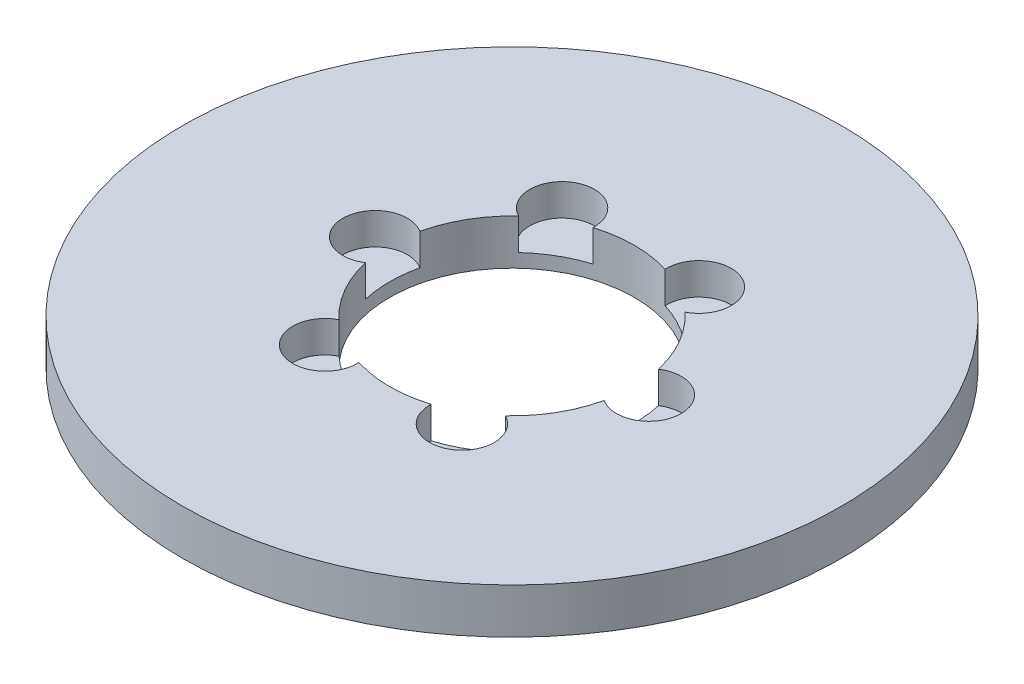
ISO-10303-21;
HEADER;
FILE_DESCRIPTION(('STEP AP214'),'2;1');
FILE_NAME('part.step','',(''),(''),'','','');
FILE_SCHEMA(('AUTOMOTIVE_DESIGN { 1 0 10303 214 1 1 1 1 }'));
ENDSEC;
DATA;
#1=APPLICATION_CONTEXT('core data for automotive mechanical design processes');
#2=APPLICATION_PROTOCOL_DEFINITION('international standard','automotive_design',2000,#1);
#3=PRODUCT_CONTEXT('',#1,'mechanical');
#4=PRODUCT('Part','Part','',(#3));
#5=PRODUCT_RELATED_PRODUCT_CATEGORY('part','',(#4));
#6=PRODUCT_DEFINITION_FORMATION('','',#4);
#7=PRODUCT_DEFINITION_CONTEXT('part definition',#1,'design');
#8=PRODUCT_DEFINITION('design','',#6,#7);
#9=PRODUCT_DEFINITION_SHAPE('','',#8);
#10=(LENGTH_UNIT() NAMED_UNIT(*) SI_UNIT(.MILLI.,.METRE.));
#11=(NAMED_UNIT(*) PLANE_ANGLE_UNIT() SI_UNIT($,.RADIAN.));
#12=(NAMED_UNIT(*) SI_UNIT($,.STERADIAN.) SOLID_ANGLE_UNIT());
#13=UNCERTAINTY_MEASURE_WITH_UNIT(LENGTH_MEASURE(1.E-05),#10,'distance_accuracy_value','');
#14=(GEOMETRIC_REPRESENTATION_CONTEXT(3) GLOBAL_UNCERTAINTY_ASSIGNED_CONTEXT((#13)) GLOBAL_UNIT_ASSIGNED_CONTEXT((#10,
#11,#12)) REPRESENTATION_CONTEXT('',''));
#15=CARTESIAN_POINT('',(0.,0.,0.));
#16=DIRECTION('',(0.,0.,1.));
#17=DIRECTION('',(1.,0.,0.));
#18=AXIS2_PLACEMENT_3D('',#15,#16,#17);
#19=CARTESIAN_POINT('',(0.,12.,0.));
#20=DIRECTION('',(0.,-1.,0.));
#21=DIRECTION('',(0.,0.,-1.));
#22=AXIS2_PLACEMENT_3D('',#19,#20,#21);
#23=CYLINDRICAL_SURFACE('',#22,87.5);
#24=CARTESIAN_POINT('',(0.,12.,0.));
#25=DIRECTION('',(0.,1.,0.));
#26=DIRECTION('',(0.,0.,1.));
#27=AXIS2_PLACEMENT_3D('',#24,#25,#26);
#28=CIRCLE('',#27,87.5);
#29=CARTESIAN_POINT('',(0.,12.,87.5));
#30=VERTEX_POINT('',#29);
#31=EDGE_CURVE('E171',#30,#30,#28,.T.);
#32=ORIENTED_EDGE('',*,*,#31,.F.);
#33=EDGE_LOOP('',(#32));
#34=FACE_BOUND('',#33,.T.);
#35=CARTESIAN_POINT('',(0.,0.,0.));
#36=DIRECTION('',(0.,1.,0.));
#37=DIRECTION('',(0.,0.,1.));
#38=AXIS2_PLACEMENT_3D('',#35,#36,#37);
#39=CIRCLE('',#38,87.5);
#40=CARTESIAN_POINT('',(0.,0.,87.5));
#41=VERTEX_POINT('',#40);
#42=EDGE_CURVE('E157',#41,#41,#39,.T.);
#43=ORIENTED_EDGE('',*,*,#42,.T.);
#44=EDGE_LOOP('',(#43));
#45=FACE_BOUND('',#44,.T.);
#46=ADVANCED_FACE('F39',(#34,#45),#23,.T.);
#47=CARTESIAN_POINT('',(0.,12.,0.));
#48=DIRECTION('',(0.,1.,0.));
#49=DIRECTION('',(0.,0.,1.));
#50=AXIS2_PLACEMENT_3D('',#47,#48,#49);
#51=PLANE('',#50);
#52=CARTESIAN_POINT('',(-18.1668003303775,12.,-31.465821183172));
#53=DIRECTION('',(0.,1.,0.));
#54=DIRECTION('',(-0.866025403784433,0.,0.50000000000001));
#55=AXIS2_PLACEMENT_3D('',#52,#53,#54);
#56=CIRCLE('',#55,8.58563519794542);
#57=CARTESIAN_POINT('',(-9.59111765397226,12.,-31.0525435696927));
#58=VERTEX_POINT('',#57);
#59=CARTESIAN_POINT('',(-22.0967327564914,12.,-23.8324233238712));
#60=VERTEX_POINT('',#59);
#61=EDGE_CURVE('E214',#58,#60,#56,.T.);
#62=ORIENTED_EDGE('',*,*,#61,.F.);
#63=CARTESIAN_POINT('',(0.,12.,0.));
#64=DIRECTION('',(0.,1.,0.));
#65=DIRECTION('',(0.,0.,1.));
#66=AXIS2_PLACEMENT_3D('',#63,#64,#65);
#67=CIRCLE('',#66,32.5);
#68=CARTESIAN_POINT('',(9.59111765397161,12.,-31.0525435696929));
#69=VERTEX_POINT('',#68);
#70=EDGE_CURVE('E272',#69,#58,#67,.T.);
#71=ORIENTED_EDGE('',*,*,#70,.F.);
#72=CARTESIAN_POINT('',(18.1668003303768,12.,-31.4658211831723));
#73=DIRECTION('',(0.,1.,0.));
#74=DIRECTION('',(-0.866025403784443,0.,-0.499999999999992));
#75=AXIS2_PLACEMENT_3D('',#72,#73,#74);
#76=CIRCLE('',#75,8.58563519794542);
#77=CARTESIAN_POINT('',(22.0967327564909,12.,-23.8324233238717));
#78=VERTEX_POINT('',#77);
#79=EDGE_CURVE('E285',#78,#69,#76,.T.);
#80=ORIENTED_EDGE('',*,*,#79,.F.);
#81=CARTESIAN_POINT('',(31.687850410463,12.,-7.22012024582133));
#82=VERTEX_POINT('',#81);
#83=EDGE_CURVE('E165',#82,#78,#67,.T.);
#84=ORIENTED_EDGE('',*,*,#83,.F.);
#85=CARTESIAN_POINT('',(36.3336006607542,12.,0.));
#86=DIRECTION('',(0.,1.,0.));
#87=DIRECTION('',(0.,0.,-1.));
#88=AXIS2_PLACEMENT_3D('',#85,#86,#87);
#89=CIRCLE('',#88,8.58563519794542);
#90=CARTESIAN_POINT('',(31.687850410463,12.,7.22012024582133));
#91=VERTEX_POINT('',#90);
#92=EDGE_CURVE('E281',#91,#82,#89,.T.);
#93=ORIENTED_EDGE('',*,*,#92,.F.);
#94=CARTESIAN_POINT('',(22.0967327564912,12.,23.8324233238714));
#95=VERTEX_POINT('',#94);
#96=EDGE_CURVE('E160',#95,#91,#67,.T.);
#97=ORIENTED_EDGE('',*,*,#96,.F.);
#98=CARTESIAN_POINT('',(18.1668003303772,12.,31.4658211831721));
#99=DIRECTION('',(0.,1.,0.));
#100=DIRECTION('',(0.866025403784436,0.,-0.500000000000004));
#101=AXIS2_PLACEMENT_3D('',#98,#99,#100);
#102=CIRCLE('',#101,8.58563519794542);
#103=CARTESIAN_POINT('',(9.59111765397204,12.,31.0525435696927));
#104=VERTEX_POINT('',#103);
#105=EDGE_CURVE('E154',#104,#95,#102,.T.);
#106=ORIENTED_EDGE('',*,*,#105,.F.);
#107=CARTESIAN_POINT('',(-9.59111765397182,12.,31.0525435696928));
#108=VERTEX_POINT('',#107);
#109=EDGE_CURVE('E150',#108,#104,#67,.T.);
#110=ORIENTED_EDGE('',*,*,#109,.F.);
#111=CARTESIAN_POINT('',(-18.166800330377,12.,31.4658211831722));
#112=DIRECTION('',(0.,1.,0.));
#113=DIRECTION('',(0.86602540378444,0.,0.499999999999998));
#114=AXIS2_PLACEMENT_3D('',#111,#112,#113);
#115=CIRCLE('',#114,8.58563519794542);
#116=CARTESIAN_POINT('',(-22.0967327564911,12.,23.8324233238715));
#117=VERTEX_POINT('',#116);
#118=EDGE_CURVE('E127',#117,#108,#115,.T.);
#119=ORIENTED_EDGE('',*,*,#118,.F.);
#120=CARTESIAN_POINT('',(-31.687850410463,12.,7.22012024582133));
#121=VERTEX_POINT('',#120);
#122=EDGE_CURVE('E156',#121,#117,#67,.T.);
#123=ORIENTED_EDGE('',*,*,#122,.F.);
#124=CARTESIAN_POINT('',(-36.3336006607542,12.,0.));
#125=DIRECTION('',(0.,1.,0.));
#126=DIRECTION('',(0.,0.,1.));
#127=AXIS2_PLACEMENT_3D('',#124,#125,#126);
#128=CIRCLE('',#127,8.58563519794542);
#129=CARTESIAN_POINT('',(-31.687850410463,12.,-7.22012024582133));
#130=VERTEX_POINT('',#129);
#131=EDGE_CURVE('E164',#130,#121,#128,.T.);
#132=ORIENTED_EDGE('',*,*,#131,.F.);
#133=EDGE_CURVE('E159',#60,#130,#67,.T.);
#134=ORIENTED_EDGE('',*,*,#133,.F.);
#135=EDGE_LOOP('',(#62,#71,#80,#84,#93,#97,#106,#110,#119,#123,#132,#134));
#136=FACE_BOUND('',#135,.T.);
#137=ORIENTED_EDGE('',*,*,#31,.T.);
#138=EDGE_LOOP('',(#137));
#139=FACE_BOUND('',#138,.T.);
#140=ADVANCED_FACE('F155',(#136,#139),#51,.T.);
#141=CARTESIAN_POINT('',(0.,0.,0.));
#142=DIRECTION('',(0.,1.,0.));
#143=DIRECTION('',(0.,0.,1.));
#144=AXIS2_PLACEMENT_3D('',#141,#142,#143);
#145=PLANE('',#144);
#146=CARTESIAN_POINT('',(0.,0.,0.));
#147=DIRECTION('',(0.,1.,0.));
#148=DIRECTION('',(0.,0.,1.));
#149=AXIS2_PLACEMENT_3D('',#146,#147,#148);
#150=CIRCLE('',#149,32.5);
#151=CARTESIAN_POINT('',(0.,0.,32.5));
#152=VERTEX_POINT('',#151);
#153=EDGE_CURVE('E170',#152,#152,#150,.T.);
#154=ORIENTED_EDGE('',*,*,#153,.T.);
#155=EDGE_LOOP('',(#154));
#156=FACE_BOUND('',#155,.T.);
#157=ORIENTED_EDGE('',*,*,#42,.F.);
#158=EDGE_LOOP('',(#157));
#159=FACE_BOUND('',#158,.T.);
#160=ADVANCED_FACE('F232',(#156,#159),#145,.F.);
#161=CARTESIAN_POINT('',(0.,12.,0.));
#162=DIRECTION('',(0.,-1.,0.));
#163=DIRECTION('',(0.,0.,-1.));
#164=AXIS2_PLACEMENT_3D('',#161,#162,#163);
#165=CYLINDRICAL_SURFACE('',#164,32.5);
#166=DIRECTION('',(0.,1.,0.));
#167=VECTOR('',#166,1.);
#168=CARTESIAN_POINT('',(-9.59111765397226,7.80302718455818,-31.0525435696927));
#169=LINE('',#168,#167);
#170=CARTESIAN_POINT('',(-9.59111765397226,3.60605436911637,-31.0525435696927));
#171=VERTEX_POINT('',#170);
#172=EDGE_CURVE('E11',#171,#58,#169,.T.);
#173=ORIENTED_EDGE('',*,*,#172,.F.);
#174=CARTESIAN_POINT('',(0.,3.60605436911637,0.));
#175=DIRECTION('',(0.,1.,0.));
#176=DIRECTION('',(0.,0.,1.));
#177=AXIS2_PLACEMENT_3D('',#174,#175,#176);
#178=CIRCLE('',#177,32.5);
#179=CARTESIAN_POINT('',(-22.0967327564914,3.60605436911637,-23.8324233238712));
#180=VERTEX_POINT('',#179);
#181=EDGE_CURVE('E209',#171,#180,#178,.T.);
#182=ORIENTED_EDGE('',*,*,#181,.T.);
#183=DIRECTION('',(0.,1.,0.));
#184=VECTOR('',#183,1.);
#185=CARTESIAN_POINT('',(-22.0967327564914,7.80302718455818,-23.8324233238712));
#186=LINE('',#185,#184);
#187=EDGE_CURVE('E46',#60,#180,#186,.F.);
#188=ORIENTED_EDGE('',*,*,#187,.F.);
#189=ORIENTED_EDGE('',*,*,#133,.T.);
#190=DIRECTION('',(0.,1.,0.));
#191=VECTOR('',#190,1.);
#192=CARTESIAN_POINT('',(-31.687850410463,7.80302718455818,-7.22012024582133));
#193=LINE('',#192,#191);
#194=CARTESIAN_POINT('',(-31.687850410463,3.60605436911637,-7.22012024582133));
#195=VERTEX_POINT('',#194);
#196=EDGE_CURVE('E185',#195,#130,#193,.T.);
#197=ORIENTED_EDGE('',*,*,#196,.F.);
#198=CARTESIAN_POINT('',(0.,3.60605436911637,0.));
#199=DIRECTION('',(0.,1.,0.));
#200=DIRECTION('',(0.,0.,1.));
#201=AXIS2_PLACEMENT_3D('',#198,#199,#200);
#202=CIRCLE('',#201,32.5);
#203=CARTESIAN_POINT('',(-31.687850410463,3.60605436911637,7.22012024582133));
#204=VERTEX_POINT('',#203);
#205=EDGE_CURVE('E173',#195,#204,#202,.T.);
#206=ORIENTED_EDGE('',*,*,#205,.T.);
#207=DIRECTION('',(0.,1.,0.));
#208=VECTOR('',#207,1.);
#209=CARTESIAN_POINT('',(-31.687850410463,7.80302718455818,7.22012024582133));
#210=LINE('',#209,#208);
#211=EDGE_CURVE('E178',#121,#204,#210,.F.);
#212=ORIENTED_EDGE('',*,*,#211,.F.);
#213=ORIENTED_EDGE('',*,*,#122,.T.);
#214=DIRECTION('',(0.,1.,0.));
#215=VECTOR('',#214,1.);
#216=CARTESIAN_POINT('',(-22.0967327564911,7.80302718455818,23.8324233238715));
#217=LINE('',#216,#215);
#218=CARTESIAN_POINT('',(-22.0967327564911,3.60605436911637,23.8324233238715));
#219=VERTEX_POINT('',#218);
#220=EDGE_CURVE('E132',#219,#117,#217,.T.);
#221=ORIENTED_EDGE('',*,*,#220,.F.);
#222=CARTESIAN_POINT('',(0.,3.60605436911637,0.));
#223=DIRECTION('',(0.,1.,0.));
#224=DIRECTION('',(0.,0.,1.));
#225=AXIS2_PLACEMENT_3D('',#222,#223,#224);
#226=CIRCLE('',#225,32.5);
#227=CARTESIAN_POINT('',(-9.59111765397182,3.60605436911637,31.0525435696928));
#228=VERTEX_POINT('',#227);
#229=EDGE_CURVE('E146',#219,#228,#226,.T.);
#230=ORIENTED_EDGE('',*,*,#229,.T.);
#231=DIRECTION('',(0.,1.,0.));
#232=VECTOR('',#231,1.);
#233=CARTESIAN_POINT('',(-9.59111765397182,7.80302718455818,31.0525435696928));
#234=LINE('',#233,#232);
#235=EDGE_CURVE('E128',#108,#228,#234,.F.);
#236=ORIENTED_EDGE('',*,*,#235,.F.);
#237=ORIENTED_EDGE('',*,*,#109,.T.);
#238=DIRECTION('',(0.,1.,0.));
#239=VECTOR('',#238,1.);
#240=CARTESIAN_POINT('',(9.59111765397204,7.80302718455818,31.0525435696927));
#241=LINE('',#240,#239);
#242=CARTESIAN_POINT('',(9.59111765397204,3.60605436911637,31.0525435696927));
#243=VERTEX_POINT('',#242);
#244=EDGE_CURVE('E192',#243,#104,#241,.T.);
#245=ORIENTED_EDGE('',*,*,#244,.F.);
#246=CARTESIAN_POINT('',(0.,3.60605436911637,0.));
#247=DIRECTION('',(0.,1.,0.));
#248=DIRECTION('',(0.,0.,1.));
#249=AXIS2_PLACEMENT_3D('',#246,#247,#248);
#250=CIRCLE('',#249,32.5);
#251=CARTESIAN_POINT('',(22.0967327564912,3.60605436911637,23.8324233238714));
#252=VERTEX_POINT('',#251);
#253=EDGE_CURVE('E190',#243,#252,#250,.T.);
#254=ORIENTED_EDGE('',*,*,#253,.T.);
#255=DIRECTION('',(0.,1.,0.));
#256=VECTOR('',#255,1.);
#257=CARTESIAN_POINT('',(22.0967327564912,7.80302718455818,23.8324233238714));
#258=LINE('',#257,#256);
#259=EDGE_CURVE('E189',#95,#252,#258,.F.);
#260=ORIENTED_EDGE('',*,*,#259,.F.);
#261=ORIENTED_EDGE('',*,*,#96,.T.);
#262=DIRECTION('',(0.,1.,0.));
#263=VECTOR('',#262,1.);
#264=CARTESIAN_POINT('',(31.687850410463,7.80302718455818,7.22012024582133));
#265=LINE('',#264,#263);
#266=CARTESIAN_POINT('',(31.687850410463,3.60605436911637,7.22012024582133));
#267=VERTEX_POINT('',#266);
#268=EDGE_CURVE('E203',#267,#91,#265,.T.);
#269=ORIENTED_EDGE('',*,*,#268,.F.);
#270=CARTESIAN_POINT('',(0.,3.60605436911637,0.));
#271=DIRECTION('',(0.,1.,0.));
#272=DIRECTION('',(0.,0.,1.));
#273=AXIS2_PLACEMENT_3D('',#270,#271,#272);
#274=CIRCLE('',#273,32.5);
#275=CARTESIAN_POINT('',(31.687850410463,3.60605436911637,-7.22012024582133));
#276=VERTEX_POINT('',#275);
#277=EDGE_CURVE('E194',#267,#276,#274,.T.);
#278=ORIENTED_EDGE('',*,*,#277,.T.);
#279=DIRECTION('',(0.,1.,0.));
#280=VECTOR('',#279,1.);
#281=CARTESIAN_POINT('',(31.687850410463,7.80302718455818,-7.22012024582133));
#282=LINE('',#281,#280);
#283=EDGE_CURVE('E196',#82,#276,#282,.F.);
#284=ORIENTED_EDGE('',*,*,#283,.F.);
#285=ORIENTED_EDGE('',*,*,#83,.T.);
#286=DIRECTION('',(0.,1.,0.));
#287=VECTOR('',#286,1.);
#288=CARTESIAN_POINT('',(22.0967327564909,7.80302718455818,-23.8324233238717));
#289=LINE('',#288,#287);
#290=CARTESIAN_POINT('',(22.0967327564909,3.60605436911637,-23.8324233238717));
#291=VERTEX_POINT('',#290);
#292=EDGE_CURVE('E208',#291,#78,#289,.T.);
#293=ORIENTED_EDGE('',*,*,#292,.F.);
#294=CARTESIAN_POINT('',(0.,3.60605436911637,0.));
#295=DIRECTION('',(0.,1.,0.));
#296=DIRECTION('',(0.,0.,1.));
#297=AXIS2_PLACEMENT_3D('',#294,#295,#296);
#298=CIRCLE('',#297,32.5);
#299=CARTESIAN_POINT('',(9.59111765397161,3.60605436911637,-31.0525435696929));
#300=VERTEX_POINT('',#299);
#301=EDGE_CURVE('E201',#291,#300,#298,.T.);
#302=ORIENTED_EDGE('',*,*,#301,.T.);
#303=DIRECTION('',(0.,1.,0.));
#304=VECTOR('',#303,1.);
#305=CARTESIAN_POINT('',(9.59111765397161,7.80302718455818,-31.0525435696929));
#306=LINE('',#305,#304);
#307=EDGE_CURVE('E206',#69,#300,#306,.F.);
#308=ORIENTED_EDGE('',*,*,#307,.F.);
#309=ORIENTED_EDGE('',*,*,#70,.T.);
#310=EDGE_LOOP('',(#173,#182,#188,#189,#197,#206,#212,#213,#221,#230,#236,#237,#245,#254,#260,
#261,#269,#278,#284,#285,#293,#302,#308,#309));
#311=FACE_BOUND('',#310,.T.);
#312=ORIENTED_EDGE('',*,*,#153,.F.);
#313=EDGE_LOOP('',(#312));
#314=FACE_BOUND('',#313,.T.);
#315=ADVANCED_FACE('F145',(#311,#314),#165,.F.);
#316=CARTESIAN_POINT('',(-36.3336006607542,3.60605436911637,0.));
#317=DIRECTION('',(0.,1.,0.));
#318=DIRECTION('',(0.,0.,1.));
#319=AXIS2_PLACEMENT_3D('',#316,#317,#318);
#320=CYLINDRICAL_SURFACE('',#319,8.58563519794542);
#321=ORIENTED_EDGE('',*,*,#196,.T.);
#322=ORIENTED_EDGE('',*,*,#131,.T.);
#323=ORIENTED_EDGE('',*,*,#211,.T.);
#324=CARTESIAN_POINT('',(-36.3336006607542,3.60605436911637,0.));
#325=DIRECTION('',(0.,1.,0.));
#326=DIRECTION('',(0.,0.,1.));
#327=AXIS2_PLACEMENT_3D('',#324,#325,#326);
#328=CIRCLE('',#327,8.58563519794542);
#329=EDGE_CURVE('E168',#195,#204,#328,.T.);
#330=ORIENTED_EDGE('',*,*,#329,.F.);
#331=EDGE_LOOP('',(#321,#322,#323,#330));
#332=FACE_BOUND('',#331,.T.);
#333=ADVANCED_FACE('F243',(#332),#320,.F.);
#334=CARTESIAN_POINT('',(-36.3336006607542,3.60605436911637,0.));
#335=DIRECTION('',(0.,1.,0.));
#336=DIRECTION('',(0.,0.,1.));
#337=AXIS2_PLACEMENT_3D('',#334,#335,#336);
#338=PLANE('',#337);
#339=ORIENTED_EDGE('',*,*,#329,.T.);
#340=ORIENTED_EDGE('',*,*,#205,.F.);
#341=EDGE_LOOP('',(#339,#340));
#342=FACE_BOUND('',#341,.T.);
#343=ADVANCED_FACE('F247',(#342),#338,.T.);
#344=CARTESIAN_POINT('',(-18.166800330377,3.60605436911637,31.4658211831722));
#345=DIRECTION('',(0.,1.,0.));
#346=DIRECTION('',(0.,0.,1.));
#347=AXIS2_PLACEMENT_3D('',#344,#345,#346);
#348=CYLINDRICAL_SURFACE('',#347,8.58563519794542);
#349=ORIENTED_EDGE('',*,*,#220,.T.);
#350=ORIENTED_EDGE('',*,*,#118,.T.);
#351=ORIENTED_EDGE('',*,*,#235,.T.);
#352=CARTESIAN_POINT('',(-18.166800330377,3.60605436911637,31.4658211831722));
#353=DIRECTION('',(0.,1.,0.));
#354=DIRECTION('',(0.86602540378444,0.,0.499999999999998));
#355=AXIS2_PLACEMENT_3D('',#352,#353,#354);
#356=CIRCLE('',#355,8.58563519794542);
#357=EDGE_CURVE('E137',#219,#228,#356,.T.);
#358=ORIENTED_EDGE('',*,*,#357,.F.);
#359=EDGE_LOOP('',(#349,#350,#351,#358));
#360=FACE_BOUND('',#359,.T.);
#361=ADVANCED_FACE('F126',(#360),#348,.F.);
#362=CARTESIAN_POINT('',(-18.166800330377,3.60605436911637,31.4658211831722));
#363=DIRECTION('',(0.,1.,0.));
#364=DIRECTION('',(0.86602540378444,0.,0.499999999999998));
#365=AXIS2_PLACEMENT_3D('',#362,#363,#364);
#366=PLANE('',#365);
#367=ORIENTED_EDGE('',*,*,#357,.T.);
#368=ORIENTED_EDGE('',*,*,#229,.F.);
#369=EDGE_LOOP('',(#367,#368));
#370=FACE_BOUND('',#369,.T.);
#371=ADVANCED_FACE('F254',(#370),#366,.T.);
#372=CARTESIAN_POINT('',(18.1668003303772,3.60605436911637,31.4658211831721));
#373=DIRECTION('',(0.,1.,0.));
#374=DIRECTION('',(0.,0.,1.));
#375=AXIS2_PLACEMENT_3D('',#372,#373,#374);
#376=CYLINDRICAL_SURFACE('',#375,8.58563519794542);
#377=ORIENTED_EDGE('',*,*,#244,.T.);
#378=ORIENTED_EDGE('',*,*,#105,.T.);
#379=ORIENTED_EDGE('',*,*,#259,.T.);
#380=CARTESIAN_POINT('',(18.1668003303772,3.60605436911637,31.4658211831721));
#381=DIRECTION('',(0.,1.,0.));
#382=DIRECTION('',(0.866025403784436,0.,-0.500000000000004));
#383=AXIS2_PLACEMENT_3D('',#380,#381,#382);
#384=CIRCLE('',#383,8.58563519794542);
#385=EDGE_CURVE('E138',#243,#252,#384,.T.);
#386=ORIENTED_EDGE('',*,*,#385,.F.);
#387=EDGE_LOOP('',(#377,#378,#379,#386));
#388=FACE_BOUND('',#387,.T.);
#389=ADVANCED_FACE('F260',(#388),#376,.F.);
#390=CARTESIAN_POINT('',(18.1668003303772,3.60605436911637,31.4658211831721));
#391=DIRECTION('',(0.,1.,0.));
#392=DIRECTION('',(0.866025403784436,0.,-0.500000000000004));
#393=AXIS2_PLACEMENT_3D('',#390,#391,#392);
#394=PLANE('',#393);
#395=ORIENTED_EDGE('',*,*,#385,.T.);
#396=ORIENTED_EDGE('',*,*,#253,.F.);
#397=EDGE_LOOP('',(#395,#396));
#398=FACE_BOUND('',#397,.T.);
#399=ADVANCED_FACE('F265',(#398),#394,.T.);
#400=CARTESIAN_POINT('',(36.3336006607542,3.60605436911637,0.));
#401=DIRECTION('',(0.,1.,0.));
#402=DIRECTION('',(0.,0.,1.));
#403=AXIS2_PLACEMENT_3D('',#400,#401,#402);
#404=CYLINDRICAL_SURFACE('',#403,8.58563519794542);
#405=ORIENTED_EDGE('',*,*,#268,.T.);
#406=ORIENTED_EDGE('',*,*,#92,.T.);
#407=ORIENTED_EDGE('',*,*,#283,.T.);
#408=CARTESIAN_POINT('',(36.3336006607542,3.60605436911637,0.));
#409=DIRECTION('',(0.,1.,0.));
#410=DIRECTION('',(0.,0.,-1.));
#411=AXIS2_PLACEMENT_3D('',#408,#409,#410);
#412=CIRCLE('',#411,8.58563519794542);
#413=EDGE_CURVE('E287',#267,#276,#412,.T.);
#414=ORIENTED_EDGE('',*,*,#413,.F.);
#415=EDGE_LOOP('',(#405,#406,#407,#414));
#416=FACE_BOUND('',#415,.T.);
#417=ADVANCED_FACE('F300',(#416),#404,.F.);
#418=CARTESIAN_POINT('',(36.3336006607542,3.60605436911637,0.));
#419=DIRECTION('',(0.,1.,0.));
#420=DIRECTION('',(0.,0.,-1.));
#421=AXIS2_PLACEMENT_3D('',#418,#419,#420);
#422=PLANE('',#421);
#423=ORIENTED_EDGE('',*,*,#413,.T.);
#424=ORIENTED_EDGE('',*,*,#277,.F.);
#425=EDGE_LOOP('',(#423,#424));
#426=FACE_BOUND('',#425,.T.);
#427=ADVANCED_FACE('F298',(#426),#422,.T.);
#428=CARTESIAN_POINT('',(18.1668003303768,3.60605436911637,-31.4658211831723));
#429=DIRECTION('',(0.,1.,0.));
#430=DIRECTION('',(0.,0.,1.));
#431=AXIS2_PLACEMENT_3D('',#428,#429,#430);
#432=CYLINDRICAL_SURFACE('',#431,8.58563519794542);
#433=ORIENTED_EDGE('',*,*,#292,.T.);
#434=ORIENTED_EDGE('',*,*,#79,.T.);
#435=ORIENTED_EDGE('',*,*,#307,.T.);
#436=CARTESIAN_POINT('',(18.1668003303768,3.60605436911637,-31.4658211831723));
#437=DIRECTION('',(0.,1.,0.));
#438=DIRECTION('',(-0.866025403784443,0.,-0.499999999999992));
#439=AXIS2_PLACEMENT_3D('',#436,#437,#438);
#440=CIRCLE('',#439,8.58563519794542);
#441=EDGE_CURVE('E56',#291,#300,#440,.T.);
#442=ORIENTED_EDGE('',*,*,#441,.F.);
#443=EDGE_LOOP('',(#433,#434,#435,#442));
#444=FACE_BOUND('',#443,.T.);
#445=ADVANCED_FACE('F301',(#444),#432,.F.);
#446=CARTESIAN_POINT('',(18.1668003303768,3.60605436911637,-31.4658211831723));
#447=DIRECTION('',(0.,1.,0.));
#448=DIRECTION('',(-0.866025403784443,0.,-0.499999999999992));
#449=AXIS2_PLACEMENT_3D('',#446,#447,#448);
#450=PLANE('',#449);
#451=ORIENTED_EDGE('',*,*,#441,.T.);
#452=ORIENTED_EDGE('',*,*,#301,.F.);
#453=EDGE_LOOP('',(#451,#452));
#454=FACE_BOUND('',#453,.T.);
#455=ADVANCED_FACE('F221',(#454),#450,.T.);
#456=CARTESIAN_POINT('',(-18.1668003303775,3.60605436911637,-31.465821183172));
#457=DIRECTION('',(0.,1.,0.));
#458=DIRECTION('',(0.,0.,1.));
#459=AXIS2_PLACEMENT_3D('',#456,#457,#458);
#460=CYLINDRICAL_SURFACE('',#459,8.58563519794542);
#461=ORIENTED_EDGE('',*,*,#172,.T.);
#462=ORIENTED_EDGE('',*,*,#61,.T.);
#463=ORIENTED_EDGE('',*,*,#187,.T.);
#464=CARTESIAN_POINT('',(-18.1668003303775,3.60605436911637,-31.465821183172));
#465=DIRECTION('',(0.,1.,0.));
#466=DIRECTION('',(-0.866025403784433,0.,0.50000000000001));
#467=AXIS2_PLACEMENT_3D('',#464,#465,#466);
#468=CIRCLE('',#467,8.58563519794542);
#469=EDGE_CURVE('E55',#171,#180,#468,.T.);
#470=ORIENTED_EDGE('',*,*,#469,.F.);
#471=EDGE_LOOP('',(#461,#462,#463,#470));
#472=FACE_BOUND('',#471,.T.);
#473=ADVANCED_FACE('F212',(#472),#460,.F.);
#474=CARTESIAN_POINT('',(-18.1668003303775,3.60605436911637,-31.465821183172));
#475=DIRECTION('',(0.,1.,0.));
#476=DIRECTION('',(-0.866025403784433,0.,0.50000000000001));
#477=AXIS2_PLACEMENT_3D('',#474,#475,#476);
#478=PLANE('',#477);
#479=ORIENTED_EDGE('',*,*,#469,.T.);
#480=ORIENTED_EDGE('',*,*,#181,.F.);
#481=EDGE_LOOP('',(#479,#480));
#482=FACE_BOUND('',#481,.T.);
#483=ADVANCED_FACE('F217',(#482),#478,.T.);
#484=CLOSED_SHELL('',(#46,#140,#160,#315,#333,#343,#361,#371,#389,#399,#417,#427,#445,#455,#473,#483));
#485=MANIFOLD_SOLID_BREP('B2',#484);
#486=ADVANCED_BREP_SHAPE_REPRESENTATION('',(#18,#485),#14);
#487=SHAPE_DEFINITION_REPRESENTATION(#9,#486);
ENDSEC;
END-ISO-10303-21;
